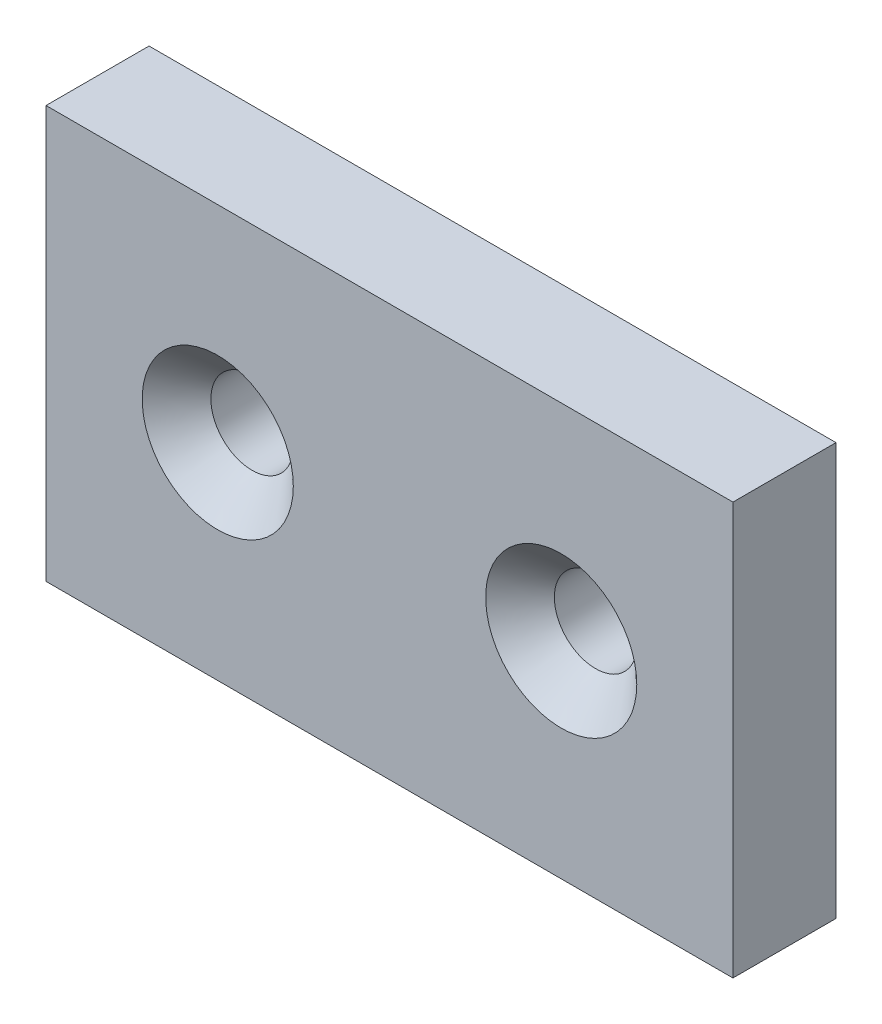
ISO-10303-21;
HEADER;
FILE_DESCRIPTION(('STEP AP214'),'2;1');
FILE_NAME('part.step','',(''),(''),'','','');
FILE_SCHEMA(('AUTOMOTIVE_DESIGN { 1 0 10303 214 1 1 1 1 }'));
ENDSEC;
DATA;
#1=APPLICATION_CONTEXT('core data for automotive mechanical design processes');
#2=APPLICATION_PROTOCOL_DEFINITION('international standard','automotive_design',2000,#1);
#3=PRODUCT_CONTEXT('',#1,'mechanical');
#4=PRODUCT('Part','Part','',(#3));
#5=PRODUCT_RELATED_PRODUCT_CATEGORY('part','',(#4));
#6=PRODUCT_DEFINITION_FORMATION('','',#4);
#7=PRODUCT_DEFINITION_CONTEXT('part definition',#1,'design');
#8=PRODUCT_DEFINITION('design','',#6,#7);
#9=PRODUCT_DEFINITION_SHAPE('','',#8);
#10=(LENGTH_UNIT() NAMED_UNIT(*) SI_UNIT(.MILLI.,.METRE.));
#11=(NAMED_UNIT(*) PLANE_ANGLE_UNIT() SI_UNIT($,.RADIAN.));
#12=(NAMED_UNIT(*) SI_UNIT($,.STERADIAN.) SOLID_ANGLE_UNIT());
#13=UNCERTAINTY_MEASURE_WITH_UNIT(LENGTH_MEASURE(1.E-05),#10,'distance_accuracy_value','');
#14=(GEOMETRIC_REPRESENTATION_CONTEXT(3) GLOBAL_UNCERTAINTY_ASSIGNED_CONTEXT((#13)) GLOBAL_UNIT_ASSIGNED_CONTEXT((#10,
#11,#12)) REPRESENTATION_CONTEXT('',''));
#15=CARTESIAN_POINT('',(0.,0.,0.));
#16=DIRECTION('',(0.,0.,1.));
#17=DIRECTION('',(1.,0.,0.));
#18=AXIS2_PLACEMENT_3D('',#15,#16,#17);
#19=CARTESIAN_POINT('',(0.,0.,3.));
#20=DIRECTION('',(1.,0.,0.));
#21=DIRECTION('',(0.,0.,-1.));
#22=AXIS2_PLACEMENT_3D('',#19,#20,#21);
#23=PLANE('',#22);
#24=DIRECTION('',(0.,-1.,0.));
#25=VECTOR('',#24,1.);
#26=CARTESIAN_POINT('',(0.,0.,3.));
#27=LINE('',#26,#25);
#28=CARTESIAN_POINT('',(-5.41705213522436E-13,15.85,3.));
#29=VERTEX_POINT('',#28);
#30=CARTESIAN_POINT('',(0.,3.84999999999997,3.));
#31=VERTEX_POINT('',#30);
#32=EDGE_CURVE('E41',#29,#31,#27,.T.);
#33=ORIENTED_EDGE('',*,*,#32,.F.);
#34=DIRECTION('',(0.,0.,-1.));
#35=VECTOR('',#34,1.);
#36=CARTESIAN_POINT('',(-5.41705213522436E-13,15.85,10.));
#37=LINE('',#36,#35);
#38=CARTESIAN_POINT('',(-5.41705213522436E-13,15.85,0.));
#39=VERTEX_POINT('',#38);
#40=EDGE_CURVE('E75',#29,#39,#37,.T.);
#41=ORIENTED_EDGE('',*,*,#40,.T.);
#42=DIRECTION('',(0.,-1.,0.));
#43=VECTOR('',#42,1.);
#44=CARTESIAN_POINT('',(0.,0.,0.));
#45=LINE('',#44,#43);
#46=CARTESIAN_POINT('',(0.,3.84999999999997,0.));
#47=VERTEX_POINT('',#46);
#48=EDGE_CURVE('E86',#39,#47,#45,.T.);
#49=ORIENTED_EDGE('',*,*,#48,.T.);
#50=DIRECTION('',(0.,0.,-1.));
#51=VECTOR('',#50,1.);
#52=CARTESIAN_POINT('',(0.,3.84999999999997,10.));
#53=LINE('',#52,#51);
#54=EDGE_CURVE('E57',#31,#47,#53,.T.);
#55=ORIENTED_EDGE('',*,*,#54,.F.);
#56=EDGE_LOOP('',(#33,#41,#49,#55));
#57=FACE_BOUND('',#56,.T.);
#58=ADVANCED_FACE('F33',(#57),#23,.F.);
#59=CARTESIAN_POINT('',(20.,0.,3.));
#60=DIRECTION('',(-1.,0.,0.));
#61=DIRECTION('',(0.,0.,1.));
#62=AXIS2_PLACEMENT_3D('',#59,#60,#61);
#63=PLANE('',#62);
#64=DIRECTION('',(0.,1.,0.));
#65=VECTOR('',#64,1.);
#66=CARTESIAN_POINT('',(20.,0.,0.));
#67=LINE('',#66,#65);
#68=CARTESIAN_POINT('',(20.0000000000003,3.84999999999997,0.));
#69=VERTEX_POINT('',#68);
#70=CARTESIAN_POINT('',(20.,15.85,0.));
#71=VERTEX_POINT('',#70);
#72=EDGE_CURVE('E36',#69,#71,#67,.T.);
#73=ORIENTED_EDGE('',*,*,#72,.T.);
#74=DIRECTION('',(0.,0.,-1.));
#75=VECTOR('',#74,1.);
#76=CARTESIAN_POINT('',(20.0000000000003,15.85,10.));
#77=LINE('',#76,#75);
#78=CARTESIAN_POINT('',(20.0000000000003,15.85,3.));
#79=VERTEX_POINT('',#78);
#80=EDGE_CURVE('E49',#79,#71,#77,.T.);
#81=ORIENTED_EDGE('',*,*,#80,.F.);
#82=DIRECTION('',(0.,1.,0.));
#83=VECTOR('',#82,1.);
#84=CARTESIAN_POINT('',(20.,0.,3.));
#85=LINE('',#84,#83);
#86=CARTESIAN_POINT('',(20.0000000000003,3.84999999999997,3.));
#87=VERTEX_POINT('',#86);
#88=EDGE_CURVE('E11',#87,#79,#85,.T.);
#89=ORIENTED_EDGE('',*,*,#88,.F.);
#90=DIRECTION('',(0.,0.,-1.));
#91=VECTOR('',#90,1.);
#92=CARTESIAN_POINT('',(20.0000000000003,3.84999999999997,10.));
#93=LINE('',#92,#91);
#94=EDGE_CURVE('E81',#87,#69,#93,.T.);
#95=ORIENTED_EDGE('',*,*,#94,.T.);
#96=EDGE_LOOP('',(#73,#81,#89,#95));
#97=FACE_BOUND('',#96,.T.);
#98=ADVANCED_FACE('F124',(#97),#63,.F.);
#99=CARTESIAN_POINT('',(0.,0.,3.));
#100=DIRECTION('',(0.,0.,-1.));
#101=DIRECTION('',(-1.,0.,0.));
#102=AXIS2_PLACEMENT_3D('',#99,#100,#101);
#103=PLANE('',#102);
#104=CARTESIAN_POINT('',(5.,9.85,3.));
#105=DIRECTION('',(0.,0.,1.));
#106=DIRECTION('',(1.,0.,0.));
#107=AXIS2_PLACEMENT_3D('',#104,#105,#106);
#108=CIRCLE('',#107,2.2);
#109=CARTESIAN_POINT('',(7.2,9.85,3.));
#110=VERTEX_POINT('',#109);
#111=EDGE_CURVE('E110',#110,#110,#108,.T.);
#112=ORIENTED_EDGE('',*,*,#111,.F.);
#113=EDGE_LOOP('',(#112));
#114=FACE_BOUND('',#113,.T.);
#115=CARTESIAN_POINT('',(15.,9.85,3.));
#116=DIRECTION('',(0.,0.,1.));
#117=DIRECTION('',(1.,0.,0.));
#118=AXIS2_PLACEMENT_3D('',#115,#116,#117);
#119=CIRCLE('',#118,2.2);
#120=CARTESIAN_POINT('',(17.2,9.85,3.));
#121=VERTEX_POINT('',#120);
#122=EDGE_CURVE('E101',#121,#121,#119,.T.);
#123=ORIENTED_EDGE('',*,*,#122,.F.);
#124=EDGE_LOOP('',(#123));
#125=FACE_BOUND('',#124,.T.);
#126=ORIENTED_EDGE('',*,*,#88,.T.);
#127=DIRECTION('',(-1.,0.,0.));
#128=VECTOR('',#127,1.);
#129=CARTESIAN_POINT('',(0.,15.85,3.));
#130=LINE('',#129,#128);
#131=EDGE_CURVE('E113',#79,#29,#130,.T.);
#132=ORIENTED_EDGE('',*,*,#131,.T.);
#133=ORIENTED_EDGE('',*,*,#32,.T.);
#134=DIRECTION('',(1.,0.,0.));
#135=VECTOR('',#134,1.);
#136=CARTESIAN_POINT('',(0.,3.84999999999997,3.));
#137=LINE('',#136,#135);
#138=EDGE_CURVE('E88',#31,#87,#137,.T.);
#139=ORIENTED_EDGE('',*,*,#138,.T.);
#140=EDGE_LOOP('',(#126,#132,#133,#139));
#141=FACE_BOUND('',#140,.T.);
#142=ADVANCED_FACE('F126',(#114,#125,#141),#103,.F.);
#143=CARTESIAN_POINT('',(0.,0.,0.));
#144=DIRECTION('',(0.,0.,-1.));
#145=DIRECTION('',(-1.,0.,0.));
#146=AXIS2_PLACEMENT_3D('',#143,#144,#145);
#147=PLANE('',#146);
#148=DIRECTION('',(-1.,0.,0.));
#149=VECTOR('',#148,1.);
#150=CARTESIAN_POINT('',(-5.41705213522436E-13,15.85,0.));
#151=LINE('',#150,#149);
#152=EDGE_CURVE('E72',#71,#39,#151,.T.);
#153=ORIENTED_EDGE('',*,*,#152,.F.);
#154=ORIENTED_EDGE('',*,*,#72,.F.);
#155=DIRECTION('',(1.,0.,0.));
#156=VECTOR('',#155,1.);
#157=CARTESIAN_POINT('',(20.0000000000003,3.84999999999997,0.));
#158=LINE('',#157,#156);
#159=EDGE_CURVE('E92',#47,#69,#158,.T.);
#160=ORIENTED_EDGE('',*,*,#159,.F.);
#161=ORIENTED_EDGE('',*,*,#48,.F.);
#162=EDGE_LOOP('',(#153,#154,#160,#161));
#163=FACE_BOUND('',#162,.T.);
#164=CARTESIAN_POINT('',(5.,9.85,0.));
#165=DIRECTION('',(0.,0.,1.));
#166=DIRECTION('',(1.,0.,0.));
#167=AXIS2_PLACEMENT_3D('',#164,#165,#166);
#168=CIRCLE('',#167,1.2);
#169=CARTESIAN_POINT('',(6.2,9.85,0.));
#170=VERTEX_POINT('',#169);
#171=EDGE_CURVE('E104',#170,#170,#168,.T.);
#172=ORIENTED_EDGE('',*,*,#171,.T.);
#173=EDGE_LOOP('',(#172));
#174=FACE_BOUND('',#173,.T.);
#175=CARTESIAN_POINT('',(15.,9.85,0.));
#176=DIRECTION('',(0.,0.,1.));
#177=DIRECTION('',(1.,0.,0.));
#178=AXIS2_PLACEMENT_3D('',#175,#176,#177);
#179=CIRCLE('',#178,1.2);
#180=CARTESIAN_POINT('',(16.2,9.85,0.));
#181=VERTEX_POINT('',#180);
#182=EDGE_CURVE('E93',#181,#181,#179,.T.);
#183=ORIENTED_EDGE('',*,*,#182,.T.);
#184=EDGE_LOOP('',(#183));
#185=FACE_BOUND('',#184,.T.);
#186=ADVANCED_FACE('F90',(#163,#174,#185),#147,.T.);
#187=CARTESIAN_POINT('',(15.,9.85,3.));
#188=DIRECTION('',(0.,0.,1.));
#189=DIRECTION('',(1.,0.,0.));
#190=AXIS2_PLACEMENT_3D('',#187,#188,#189);
#191=CYLINDRICAL_SURFACE('',#190,1.19999999999999);
#192=ORIENTED_EDGE('',*,*,#182,.F.);
#193=EDGE_LOOP('',(#192));
#194=FACE_BOUND('',#193,.T.);
#195=CARTESIAN_POINT('',(15.,9.85,2.));
#196=DIRECTION('',(0.,0.,1.));
#197=DIRECTION('',(1.,0.,0.));
#198=AXIS2_PLACEMENT_3D('',#195,#196,#197);
#199=CIRCLE('',#198,1.19999999999999);
#200=CARTESIAN_POINT('',(16.2,9.85,2.));
#201=VERTEX_POINT('',#200);
#202=EDGE_CURVE('E95',#201,#201,#199,.T.);
#203=ORIENTED_EDGE('',*,*,#202,.T.);
#204=EDGE_LOOP('',(#203));
#205=FACE_BOUND('',#204,.T.);
#206=ADVANCED_FACE('F134',(#194,#205),#191,.F.);
#207=CARTESIAN_POINT('',(15.,9.85,3.));
#208=DIRECTION('',(0.,0.,1.));
#209=DIRECTION('',(1.,0.,0.));
#210=AXIS2_PLACEMENT_3D('',#207,#208,#209);
#211=CONICAL_SURFACE('',#210,2.2,0.785398163397453);
#212=ORIENTED_EDGE('',*,*,#202,.F.);
#213=EDGE_LOOP('',(#212));
#214=FACE_BOUND('',#213,.T.);
#215=ORIENTED_EDGE('',*,*,#122,.T.);
#216=EDGE_LOOP('',(#215));
#217=FACE_BOUND('',#216,.T.);
#218=ADVANCED_FACE('F188',(#214,#217),#211,.F.);
#219=CARTESIAN_POINT('',(5.,9.85,3.));
#220=DIRECTION('',(0.,0.,1.));
#221=DIRECTION('',(1.,0.,0.));
#222=AXIS2_PLACEMENT_3D('',#219,#220,#221);
#223=CYLINDRICAL_SURFACE('',#222,1.19999999999999);
#224=ORIENTED_EDGE('',*,*,#171,.F.);
#225=EDGE_LOOP('',(#224));
#226=FACE_BOUND('',#225,.T.);
#227=CARTESIAN_POINT('',(5.,9.85,2.));
#228=DIRECTION('',(0.,0.,1.));
#229=DIRECTION('',(1.,0.,0.));
#230=AXIS2_PLACEMENT_3D('',#227,#228,#229);
#231=CIRCLE('',#230,1.19999999999999);
#232=CARTESIAN_POINT('',(6.19999999999999,9.85,2.));
#233=VERTEX_POINT('',#232);
#234=EDGE_CURVE('E107',#233,#233,#231,.T.);
#235=ORIENTED_EDGE('',*,*,#234,.T.);
#236=EDGE_LOOP('',(#235));
#237=FACE_BOUND('',#236,.T.);
#238=ADVANCED_FACE('F184',(#226,#237),#223,.F.);
#239=CARTESIAN_POINT('',(5.,9.85,3.));
#240=DIRECTION('',(0.,0.,1.));
#241=DIRECTION('',(1.,0.,0.));
#242=AXIS2_PLACEMENT_3D('',#239,#240,#241);
#243=CONICAL_SURFACE('',#242,2.2,0.785398163397453);
#244=ORIENTED_EDGE('',*,*,#234,.F.);
#245=EDGE_LOOP('',(#244));
#246=FACE_BOUND('',#245,.T.);
#247=ORIENTED_EDGE('',*,*,#111,.T.);
#248=EDGE_LOOP('',(#247));
#249=FACE_BOUND('',#248,.T.);
#250=ADVANCED_FACE('F168',(#246,#249),#243,.F.);
#251=CARTESIAN_POINT('',(20.0000000000003,3.84999999999997,10.));
#252=DIRECTION('',(0.,1.,0.));
#253=DIRECTION('',(0.,0.,1.));
#254=AXIS2_PLACEMENT_3D('',#251,#252,#253);
#255=PLANE('',#254);
#256=ORIENTED_EDGE('',*,*,#54,.T.);
#257=ORIENTED_EDGE('',*,*,#159,.T.);
#258=ORIENTED_EDGE('',*,*,#94,.F.);
#259=ORIENTED_EDGE('',*,*,#138,.F.);
#260=EDGE_LOOP('',(#256,#257,#258,#259));
#261=FACE_BOUND('',#260,.T.);
#262=ADVANCED_FACE('F121',(#261),#255,.F.);
#263=CARTESIAN_POINT('',(-5.41705213522436E-13,15.85,10.));
#264=DIRECTION('',(0.,-1.,0.));
#265=DIRECTION('',(1.,0.,0.));
#266=AXIS2_PLACEMENT_3D('',#263,#264,#265);
#267=PLANE('',#266);
#268=ORIENTED_EDGE('',*,*,#80,.T.);
#269=ORIENTED_EDGE('',*,*,#152,.T.);
#270=ORIENTED_EDGE('',*,*,#40,.F.);
#271=ORIENTED_EDGE('',*,*,#131,.F.);
#272=EDGE_LOOP('',(#268,#269,#270,#271));
#273=FACE_BOUND('',#272,.T.);
#274=ADVANCED_FACE('F74',(#273),#267,.F.);
#275=CLOSED_SHELL('',(#58,#98,#142,#186,#206,#218,#238,#250,#262,#274));
#276=MANIFOLD_SOLID_BREP('B2',#275);
#277=ADVANCED_BREP_SHAPE_REPRESENTATION('',(#18,#276),#14);
#278=SHAPE_DEFINITION_REPRESENTATION(#9,#277);
ENDSEC;
END-ISO-10303-21;
